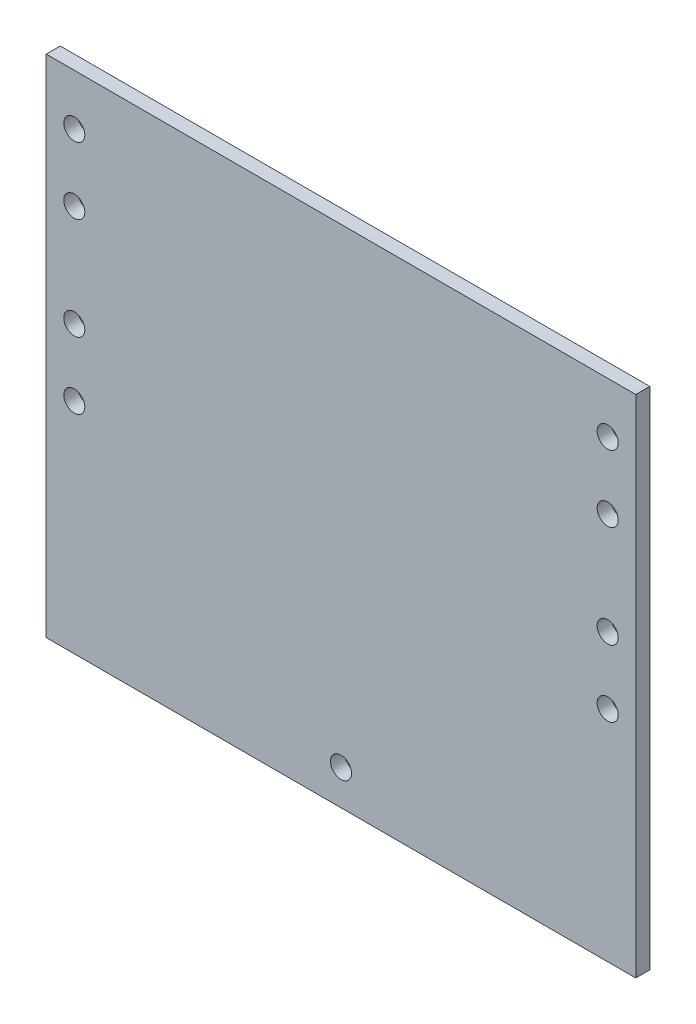
ISO-10303-21;
HEADER;
FILE_DESCRIPTION(('STEP AP214'),'2;1');
FILE_NAME('part.step','',(''),(''),'','','');
FILE_SCHEMA(('AUTOMOTIVE_DESIGN { 1 0 10303 214 1 1 1 1 }'));
ENDSEC;
DATA;
#1=APPLICATION_CONTEXT('core data for automotive mechanical design processes');
#2=APPLICATION_PROTOCOL_DEFINITION('international standard','automotive_design',2000,#1);
#3=PRODUCT_CONTEXT('',#1,'mechanical');
#4=PRODUCT('Part','Part','',(#3));
#5=PRODUCT_RELATED_PRODUCT_CATEGORY('part','',(#4));
#6=PRODUCT_DEFINITION_FORMATION('','',#4);
#7=PRODUCT_DEFINITION_CONTEXT('part definition',#1,'design');
#8=PRODUCT_DEFINITION('design','',#6,#7);
#9=PRODUCT_DEFINITION_SHAPE('','',#8);
#10=(LENGTH_UNIT() NAMED_UNIT(*) SI_UNIT(.MILLI.,.METRE.));
#11=(NAMED_UNIT(*) PLANE_ANGLE_UNIT() SI_UNIT($,.RADIAN.));
#12=(NAMED_UNIT(*) SI_UNIT($,.STERADIAN.) SOLID_ANGLE_UNIT());
#13=UNCERTAINTY_MEASURE_WITH_UNIT(LENGTH_MEASURE(1.E-05),#10,'distance_accuracy_value','');
#14=(GEOMETRIC_REPRESENTATION_CONTEXT(3) GLOBAL_UNCERTAINTY_ASSIGNED_CONTEXT((#13)) GLOBAL_UNIT_ASSIGNED_CONTEXT((#10,
#11,#12)) REPRESENTATION_CONTEXT('',''));
#15=CARTESIAN_POINT('',(0.,0.,0.));
#16=DIRECTION('',(0.,0.,1.));
#17=DIRECTION('',(1.,0.,0.));
#18=AXIS2_PLACEMENT_3D('',#15,#16,#17);
#19=CARTESIAN_POINT('',(0.,0.,12.7));
#20=DIRECTION('',(1.,0.,0.));
#21=DIRECTION('',(0.,1.,0.));
#22=AXIS2_PLACEMENT_3D('',#19,#20,#21);
#23=PLANE('',#22);
#24=DIRECTION('',(0.,-1.,0.));
#25=VECTOR('',#24,1.);
#26=CARTESIAN_POINT('',(0.,0.,0.));
#27=LINE('',#26,#25);
#28=CARTESIAN_POINT('',(0.,0.,0.));
#29=VERTEX_POINT('',#28);
#30=CARTESIAN_POINT('',(0.,-457.2,0.));
#31=VERTEX_POINT('',#30);
#32=EDGE_CURVE('E80',#29,#31,#27,.T.);
#33=ORIENTED_EDGE('',*,*,#32,.T.);
#34=DIRECTION('',(0.,0.,-1.));
#35=VECTOR('',#34,1.);
#36=CARTESIAN_POINT('',(0.,-457.2,12.7));
#37=LINE('',#36,#35);
#38=CARTESIAN_POINT('',(0.,-457.2,12.7));
#39=VERTEX_POINT('',#38);
#40=EDGE_CURVE('E11',#39,#31,#37,.T.);
#41=ORIENTED_EDGE('',*,*,#40,.F.);
#42=DIRECTION('',(0.,-1.,0.));
#43=VECTOR('',#42,1.);
#44=CARTESIAN_POINT('',(0.,0.,12.7));
#45=LINE('',#44,#43);
#46=CARTESIAN_POINT('',(0.,0.,12.7));
#47=VERTEX_POINT('',#46);
#48=EDGE_CURVE('E68',#47,#39,#45,.T.);
#49=ORIENTED_EDGE('',*,*,#48,.F.);
#50=DIRECTION('',(0.,0.,-1.));
#51=VECTOR('',#50,1.);
#52=CARTESIAN_POINT('',(0.,0.,12.7));
#53=LINE('',#52,#51);
#54=EDGE_CURVE('E76',#47,#29,#53,.T.);
#55=ORIENTED_EDGE('',*,*,#54,.T.);
#56=EDGE_LOOP('',(#33,#41,#49,#55));
#57=FACE_BOUND('',#56,.T.);
#58=ADVANCED_FACE('F17',(#57),#23,.F.);
#59=CARTESIAN_POINT('',(0.,-457.2,12.7));
#60=DIRECTION('',(0.,1.,0.));
#61=DIRECTION('',(0.,0.,1.));
#62=AXIS2_PLACEMENT_3D('',#59,#60,#61);
#63=PLANE('',#62);
#64=DIRECTION('',(1.,0.,0.));
#65=VECTOR('',#64,1.);
#66=CARTESIAN_POINT('',(0.,-457.2,0.));
#67=LINE('',#66,#65);
#68=CARTESIAN_POINT('',(533.4,-457.2,0.));
#69=VERTEX_POINT('',#68);
#70=EDGE_CURVE('E72',#31,#69,#67,.T.);
#71=ORIENTED_EDGE('',*,*,#70,.T.);
#72=DIRECTION('',(0.,0.,-1.));
#73=VECTOR('',#72,1.);
#74=CARTESIAN_POINT('',(533.4,-457.2,12.7));
#75=LINE('',#74,#73);
#76=CARTESIAN_POINT('',(533.4,-457.2,12.7));
#77=VERTEX_POINT('',#76);
#78=EDGE_CURVE('E25',#77,#69,#75,.T.);
#79=ORIENTED_EDGE('',*,*,#78,.F.);
#80=DIRECTION('',(1.,0.,0.));
#81=VECTOR('',#80,1.);
#82=CARTESIAN_POINT('',(0.,-457.2,12.7));
#83=LINE('',#82,#81);
#84=EDGE_CURVE('E63',#39,#77,#83,.T.);
#85=ORIENTED_EDGE('',*,*,#84,.F.);
#86=ORIENTED_EDGE('',*,*,#40,.T.);
#87=EDGE_LOOP('',(#71,#79,#85,#86));
#88=FACE_BOUND('',#87,.T.);
#89=ADVANCED_FACE('F71',(#88),#63,.F.);
#90=CARTESIAN_POINT('',(533.4,0.,12.7));
#91=DIRECTION('',(-1.,0.,0.));
#92=DIRECTION('',(0.,-1.,0.));
#93=AXIS2_PLACEMENT_3D('',#90,#91,#92);
#94=PLANE('',#93);
#95=DIRECTION('',(0.,1.,0.));
#96=VECTOR('',#95,1.);
#97=CARTESIAN_POINT('',(533.4,0.,0.));
#98=LINE('',#97,#96);
#99=CARTESIAN_POINT('',(533.4,0.,0.));
#100=VERTEX_POINT('',#99);
#101=EDGE_CURVE('E50',#69,#100,#98,.T.);
#102=ORIENTED_EDGE('',*,*,#101,.T.);
#103=DIRECTION('',(0.,0.,-1.));
#104=VECTOR('',#103,1.);
#105=CARTESIAN_POINT('',(533.4,0.,12.7));
#106=LINE('',#105,#104);
#107=CARTESIAN_POINT('',(533.4,0.,12.7));
#108=VERTEX_POINT('',#107);
#109=EDGE_CURVE('E73',#108,#100,#106,.T.);
#110=ORIENTED_EDGE('',*,*,#109,.F.);
#111=DIRECTION('',(0.,1.,0.));
#112=VECTOR('',#111,1.);
#113=CARTESIAN_POINT('',(533.4,0.,12.7));
#114=LINE('',#113,#112);
#115=EDGE_CURVE('E66',#77,#108,#114,.T.);
#116=ORIENTED_EDGE('',*,*,#115,.F.);
#117=ORIENTED_EDGE('',*,*,#78,.T.);
#118=EDGE_LOOP('',(#102,#110,#116,#117));
#119=FACE_BOUND('',#118,.T.);
#120=ADVANCED_FACE('F74',(#119),#94,.F.);
#121=CARTESIAN_POINT('',(0.,0.,12.7));
#122=DIRECTION('',(0.,-1.,0.));
#123=DIRECTION('',(0.,0.,-1.));
#124=AXIS2_PLACEMENT_3D('',#121,#122,#123);
#125=PLANE('',#124);
#126=DIRECTION('',(-1.,0.,0.));
#127=VECTOR('',#126,1.);
#128=CARTESIAN_POINT('',(0.,0.,0.));
#129=LINE('',#128,#127);
#130=EDGE_CURVE('E56',#100,#29,#129,.T.);
#131=ORIENTED_EDGE('',*,*,#130,.T.);
#132=ORIENTED_EDGE('',*,*,#54,.F.);
#133=DIRECTION('',(-1.,0.,0.));
#134=VECTOR('',#133,1.);
#135=CARTESIAN_POINT('',(0.,0.,12.7));
#136=LINE('',#135,#134);
#137=EDGE_CURVE('E33',#108,#47,#136,.T.);
#138=ORIENTED_EDGE('',*,*,#137,.F.);
#139=ORIENTED_EDGE('',*,*,#109,.T.);
#140=EDGE_LOOP('',(#131,#132,#138,#139));
#141=FACE_BOUND('',#140,.T.);
#142=ADVANCED_FACE('F88',(#141),#125,.F.);
#143=CARTESIAN_POINT('',(0.,0.,12.7));
#144=DIRECTION('',(0.,0.,1.));
#145=DIRECTION('',(1.,0.,0.));
#146=AXIS2_PLACEMENT_3D('',#143,#144,#145);
#147=PLANE('',#146);
#148=CARTESIAN_POINT('',(266.7,-425.45,12.7));
#149=DIRECTION('',(0.,0.,-1.));
#150=DIRECTION('',(-1.,0.,0.));
#151=AXIS2_PLACEMENT_3D('',#148,#149,#150);
#152=CIRCLE('',#151,9.525);
#153=CARTESIAN_POINT('',(257.175,-425.45,12.7));
#154=VERTEX_POINT('',#153);
#155=EDGE_CURVE('E139',#154,#154,#152,.T.);
#156=ORIENTED_EDGE('',*,*,#155,.T.);
#157=EDGE_LOOP('',(#156));
#158=FACE_BOUND('',#157,.T.);
#159=CARTESIAN_POINT('',(25.4,-45.974,12.7));
#160=DIRECTION('',(0.,0.,-1.));
#161=DIRECTION('',(1.,0.,0.));
#162=AXIS2_PLACEMENT_3D('',#159,#160,#161);
#163=CIRCLE('',#162,9.525);
#164=CARTESIAN_POINT('',(34.925,-45.974,12.7));
#165=VERTEX_POINT('',#164);
#166=EDGE_CURVE('E133',#165,#165,#163,.T.);
#167=ORIENTED_EDGE('',*,*,#166,.T.);
#168=EDGE_LOOP('',(#167));
#169=FACE_BOUND('',#168,.T.);
#170=CARTESIAN_POINT('',(25.4,-106.426,12.7));
#171=DIRECTION('',(0.,0.,-1.));
#172=DIRECTION('',(1.,0.,0.));
#173=AXIS2_PLACEMENT_3D('',#170,#171,#172);
#174=CIRCLE('',#173,9.525);
#175=CARTESIAN_POINT('',(34.925,-106.426,12.7));
#176=VERTEX_POINT('',#175);
#177=EDGE_CURVE('E127',#176,#176,#174,.T.);
#178=ORIENTED_EDGE('',*,*,#177,.T.);
#179=EDGE_LOOP('',(#178));
#180=FACE_BOUND('',#179,.T.);
#181=CARTESIAN_POINT('',(25.4,-198.628,12.7));
#182=DIRECTION('',(0.,0.,-1.));
#183=DIRECTION('',(1.,0.,0.));
#184=AXIS2_PLACEMENT_3D('',#181,#182,#183);
#185=CIRCLE('',#184,9.525);
#186=CARTESIAN_POINT('',(34.925,-198.628,12.7));
#187=VERTEX_POINT('',#186);
#188=EDGE_CURVE('E121',#187,#187,#185,.T.);
#189=ORIENTED_EDGE('',*,*,#188,.T.);
#190=EDGE_LOOP('',(#189));
#191=FACE_BOUND('',#190,.T.);
#192=CARTESIAN_POINT('',(25.4,-259.08,12.7));
#193=DIRECTION('',(0.,0.,-1.));
#194=DIRECTION('',(1.,0.,0.));
#195=AXIS2_PLACEMENT_3D('',#192,#193,#194);
#196=CIRCLE('',#195,9.525);
#197=CARTESIAN_POINT('',(34.925,-259.08,12.7));
#198=VERTEX_POINT('',#197);
#199=EDGE_CURVE('E115',#198,#198,#196,.T.);
#200=ORIENTED_EDGE('',*,*,#199,.T.);
#201=EDGE_LOOP('',(#200));
#202=FACE_BOUND('',#201,.T.);
#203=CARTESIAN_POINT('',(508.,-259.08,12.7));
#204=DIRECTION('',(0.,0.,-1.));
#205=DIRECTION('',(-1.,0.,0.));
#206=AXIS2_PLACEMENT_3D('',#203,#204,#205);
#207=CIRCLE('',#206,9.525);
#208=CARTESIAN_POINT('',(498.475,-259.08,12.7));
#209=VERTEX_POINT('',#208);
#210=EDGE_CURVE('E109',#209,#209,#207,.T.);
#211=ORIENTED_EDGE('',*,*,#210,.T.);
#212=EDGE_LOOP('',(#211));
#213=FACE_BOUND('',#212,.T.);
#214=CARTESIAN_POINT('',(508.,-198.628,12.7));
#215=DIRECTION('',(0.,0.,-1.));
#216=DIRECTION('',(-1.,0.,0.));
#217=AXIS2_PLACEMENT_3D('',#214,#215,#216);
#218=CIRCLE('',#217,9.525);
#219=CARTESIAN_POINT('',(498.475,-198.628,12.7));
#220=VERTEX_POINT('',#219);
#221=EDGE_CURVE('E103',#220,#220,#218,.T.);
#222=ORIENTED_EDGE('',*,*,#221,.T.);
#223=EDGE_LOOP('',(#222));
#224=FACE_BOUND('',#223,.T.);
#225=CARTESIAN_POINT('',(508.,-106.426,12.7));
#226=DIRECTION('',(0.,0.,-1.));
#227=DIRECTION('',(-1.,0.,0.));
#228=AXIS2_PLACEMENT_3D('',#225,#226,#227);
#229=CIRCLE('',#228,9.525);
#230=CARTESIAN_POINT('',(498.475,-106.426,12.7));
#231=VERTEX_POINT('',#230);
#232=EDGE_CURVE('E97',#231,#231,#229,.T.);
#233=ORIENTED_EDGE('',*,*,#232,.T.);
#234=EDGE_LOOP('',(#233));
#235=FACE_BOUND('',#234,.T.);
#236=CARTESIAN_POINT('',(508.,-45.974,12.7));
#237=DIRECTION('',(0.,0.,-1.));
#238=DIRECTION('',(-1.,0.,0.));
#239=AXIS2_PLACEMENT_3D('',#236,#237,#238);
#240=CIRCLE('',#239,9.525);
#241=CARTESIAN_POINT('',(498.475,-45.974,12.7));
#242=VERTEX_POINT('',#241);
#243=EDGE_CURVE('E83',#242,#242,#240,.T.);
#244=ORIENTED_EDGE('',*,*,#243,.T.);
#245=EDGE_LOOP('',(#244));
#246=FACE_BOUND('',#245,.T.);
#247=ORIENTED_EDGE('',*,*,#48,.T.);
#248=ORIENTED_EDGE('',*,*,#84,.T.);
#249=ORIENTED_EDGE('',*,*,#115,.T.);
#250=ORIENTED_EDGE('',*,*,#137,.T.);
#251=EDGE_LOOP('',(#247,#248,#249,#250));
#252=FACE_BOUND('',#251,.T.);
#253=ADVANCED_FACE('F64',(#158,#169,#180,#191,#202,#213,#224,#235,#246,#252),#147,.T.);
#254=CARTESIAN_POINT('',(0.,0.,0.));
#255=DIRECTION('',(0.,0.,1.));
#256=DIRECTION('',(1.,0.,0.));
#257=AXIS2_PLACEMENT_3D('',#254,#255,#256);
#258=PLANE('',#257);
#259=CARTESIAN_POINT('',(266.7,-425.45,0.));
#260=DIRECTION('',(0.,0.,-1.));
#261=DIRECTION('',(-1.,0.,0.));
#262=AXIS2_PLACEMENT_3D('',#259,#260,#261);
#263=CIRCLE('',#262,9.525);
#264=CARTESIAN_POINT('',(257.175,-425.45,0.));
#265=VERTEX_POINT('',#264);
#266=EDGE_CURVE('E142',#265,#265,#263,.T.);
#267=ORIENTED_EDGE('',*,*,#266,.F.);
#268=EDGE_LOOP('',(#267));
#269=FACE_BOUND('',#268,.T.);
#270=CARTESIAN_POINT('',(25.4,-45.974,0.));
#271=DIRECTION('',(0.,0.,-1.));
#272=DIRECTION('',(1.,0.,0.));
#273=AXIS2_PLACEMENT_3D('',#270,#271,#272);
#274=CIRCLE('',#273,9.525);
#275=CARTESIAN_POINT('',(34.925,-45.974,0.));
#276=VERTEX_POINT('',#275);
#277=EDGE_CURVE('E136',#276,#276,#274,.T.);
#278=ORIENTED_EDGE('',*,*,#277,.F.);
#279=EDGE_LOOP('',(#278));
#280=FACE_BOUND('',#279,.T.);
#281=CARTESIAN_POINT('',(25.4,-106.426,0.));
#282=DIRECTION('',(0.,0.,-1.));
#283=DIRECTION('',(1.,0.,0.));
#284=AXIS2_PLACEMENT_3D('',#281,#282,#283);
#285=CIRCLE('',#284,9.525);
#286=CARTESIAN_POINT('',(34.925,-106.426,0.));
#287=VERTEX_POINT('',#286);
#288=EDGE_CURVE('E130',#287,#287,#285,.T.);
#289=ORIENTED_EDGE('',*,*,#288,.F.);
#290=EDGE_LOOP('',(#289));
#291=FACE_BOUND('',#290,.T.);
#292=CARTESIAN_POINT('',(25.4,-198.628,0.));
#293=DIRECTION('',(0.,0.,-1.));
#294=DIRECTION('',(1.,0.,0.));
#295=AXIS2_PLACEMENT_3D('',#292,#293,#294);
#296=CIRCLE('',#295,9.525);
#297=CARTESIAN_POINT('',(34.925,-198.628,0.));
#298=VERTEX_POINT('',#297);
#299=EDGE_CURVE('E124',#298,#298,#296,.T.);
#300=ORIENTED_EDGE('',*,*,#299,.F.);
#301=EDGE_LOOP('',(#300));
#302=FACE_BOUND('',#301,.T.);
#303=CARTESIAN_POINT('',(25.4,-259.08,0.));
#304=DIRECTION('',(0.,0.,-1.));
#305=DIRECTION('',(1.,0.,0.));
#306=AXIS2_PLACEMENT_3D('',#303,#304,#305);
#307=CIRCLE('',#306,9.525);
#308=CARTESIAN_POINT('',(34.925,-259.08,0.));
#309=VERTEX_POINT('',#308);
#310=EDGE_CURVE('E118',#309,#309,#307,.T.);
#311=ORIENTED_EDGE('',*,*,#310,.F.);
#312=EDGE_LOOP('',(#311));
#313=FACE_BOUND('',#312,.T.);
#314=CARTESIAN_POINT('',(508.,-259.08,0.));
#315=DIRECTION('',(0.,0.,-1.));
#316=DIRECTION('',(-1.,0.,0.));
#317=AXIS2_PLACEMENT_3D('',#314,#315,#316);
#318=CIRCLE('',#317,9.525);
#319=CARTESIAN_POINT('',(498.475,-259.08,0.));
#320=VERTEX_POINT('',#319);
#321=EDGE_CURVE('E112',#320,#320,#318,.T.);
#322=ORIENTED_EDGE('',*,*,#321,.F.);
#323=EDGE_LOOP('',(#322));
#324=FACE_BOUND('',#323,.T.);
#325=CARTESIAN_POINT('',(508.,-198.628,0.));
#326=DIRECTION('',(0.,0.,-1.));
#327=DIRECTION('',(-1.,0.,0.));
#328=AXIS2_PLACEMENT_3D('',#325,#326,#327);
#329=CIRCLE('',#328,9.525);
#330=CARTESIAN_POINT('',(498.475,-198.628,0.));
#331=VERTEX_POINT('',#330);
#332=EDGE_CURVE('E106',#331,#331,#329,.T.);
#333=ORIENTED_EDGE('',*,*,#332,.F.);
#334=EDGE_LOOP('',(#333));
#335=FACE_BOUND('',#334,.T.);
#336=CARTESIAN_POINT('',(508.,-106.426,0.));
#337=DIRECTION('',(0.,0.,-1.));
#338=DIRECTION('',(-1.,0.,0.));
#339=AXIS2_PLACEMENT_3D('',#336,#337,#338);
#340=CIRCLE('',#339,9.525);
#341=CARTESIAN_POINT('',(498.475,-106.426,0.));
#342=VERTEX_POINT('',#341);
#343=EDGE_CURVE('E100',#342,#342,#340,.T.);
#344=ORIENTED_EDGE('',*,*,#343,.F.);
#345=EDGE_LOOP('',(#344));
#346=FACE_BOUND('',#345,.T.);
#347=CARTESIAN_POINT('',(508.,-45.974,0.));
#348=DIRECTION('',(0.,0.,-1.));
#349=DIRECTION('',(-1.,0.,0.));
#350=AXIS2_PLACEMENT_3D('',#347,#348,#349);
#351=CIRCLE('',#350,9.525);
#352=CARTESIAN_POINT('',(498.475,-45.974,0.));
#353=VERTEX_POINT('',#352);
#354=EDGE_CURVE('E94',#353,#353,#351,.T.);
#355=ORIENTED_EDGE('',*,*,#354,.F.);
#356=EDGE_LOOP('',(#355));
#357=FACE_BOUND('',#356,.T.);
#358=ORIENTED_EDGE('',*,*,#32,.F.);
#359=ORIENTED_EDGE('',*,*,#130,.F.);
#360=ORIENTED_EDGE('',*,*,#101,.F.);
#361=ORIENTED_EDGE('',*,*,#70,.F.);
#362=EDGE_LOOP('',(#358,#359,#360,#361));
#363=FACE_BOUND('',#362,.T.);
#364=ADVANCED_FACE('F91',(#269,#280,#291,#302,#313,#324,#335,#346,#357,#363),#258,.F.);
#365=CARTESIAN_POINT('',(508.,-45.974,12.7));
#366=DIRECTION('',(0.,0.,-1.));
#367=DIRECTION('',(-1.,0.,0.));
#368=AXIS2_PLACEMENT_3D('',#365,#366,#367);
#369=CYLINDRICAL_SURFACE('',#368,9.525);
#370=ORIENTED_EDGE('',*,*,#243,.F.);
#371=EDGE_LOOP('',(#370));
#372=FACE_BOUND('',#371,.T.);
#373=ORIENTED_EDGE('',*,*,#354,.T.);
#374=EDGE_LOOP('',(#373));
#375=FACE_BOUND('',#374,.T.);
#376=ADVANCED_FACE('F159',(#372,#375),#369,.F.);
#377=CARTESIAN_POINT('',(508.,-106.426,12.7));
#378=DIRECTION('',(0.,0.,-1.));
#379=DIRECTION('',(-1.,0.,0.));
#380=AXIS2_PLACEMENT_3D('',#377,#378,#379);
#381=CYLINDRICAL_SURFACE('',#380,9.525);
#382=ORIENTED_EDGE('',*,*,#232,.F.);
#383=EDGE_LOOP('',(#382));
#384=FACE_BOUND('',#383,.T.);
#385=ORIENTED_EDGE('',*,*,#343,.T.);
#386=EDGE_LOOP('',(#385));
#387=FACE_BOUND('',#386,.T.);
#388=ADVANCED_FACE('F178',(#384,#387),#381,.F.);
#389=CARTESIAN_POINT('',(508.,-198.628,12.7));
#390=DIRECTION('',(0.,0.,-1.));
#391=DIRECTION('',(-1.,0.,0.));
#392=AXIS2_PLACEMENT_3D('',#389,#390,#391);
#393=CYLINDRICAL_SURFACE('',#392,9.525);
#394=ORIENTED_EDGE('',*,*,#221,.F.);
#395=EDGE_LOOP('',(#394));
#396=FACE_BOUND('',#395,.T.);
#397=ORIENTED_EDGE('',*,*,#332,.T.);
#398=EDGE_LOOP('',(#397));
#399=FACE_BOUND('',#398,.T.);
#400=ADVANCED_FACE('F186',(#396,#399),#393,.F.);
#401=CARTESIAN_POINT('',(508.,-259.08,12.7));
#402=DIRECTION('',(0.,0.,-1.));
#403=DIRECTION('',(-1.,0.,0.));
#404=AXIS2_PLACEMENT_3D('',#401,#402,#403);
#405=CYLINDRICAL_SURFACE('',#404,9.525);
#406=ORIENTED_EDGE('',*,*,#210,.F.);
#407=EDGE_LOOP('',(#406));
#408=FACE_BOUND('',#407,.T.);
#409=ORIENTED_EDGE('',*,*,#321,.T.);
#410=EDGE_LOOP('',(#409));
#411=FACE_BOUND('',#410,.T.);
#412=ADVANCED_FACE('F239',(#408,#411),#405,.F.);
#413=CARTESIAN_POINT('',(25.4,-259.08,12.7));
#414=DIRECTION('',(0.,0.,-1.));
#415=DIRECTION('',(-1.,0.,0.));
#416=AXIS2_PLACEMENT_3D('',#413,#414,#415);
#417=CYLINDRICAL_SURFACE('',#416,9.525);
#418=ORIENTED_EDGE('',*,*,#199,.F.);
#419=EDGE_LOOP('',(#418));
#420=FACE_BOUND('',#419,.T.);
#421=ORIENTED_EDGE('',*,*,#310,.T.);
#422=EDGE_LOOP('',(#421));
#423=FACE_BOUND('',#422,.T.);
#424=ADVANCED_FACE('F249',(#420,#423),#417,.F.);
#425=CARTESIAN_POINT('',(25.4,-198.628,12.7));
#426=DIRECTION('',(0.,0.,-1.));
#427=DIRECTION('',(-1.,0.,0.));
#428=AXIS2_PLACEMENT_3D('',#425,#426,#427);
#429=CYLINDRICAL_SURFACE('',#428,9.525);
#430=ORIENTED_EDGE('',*,*,#188,.F.);
#431=EDGE_LOOP('',(#430));
#432=FACE_BOUND('',#431,.T.);
#433=ORIENTED_EDGE('',*,*,#299,.T.);
#434=EDGE_LOOP('',(#433));
#435=FACE_BOUND('',#434,.T.);
#436=ADVANCED_FACE('F259',(#432,#435),#429,.F.);
#437=CARTESIAN_POINT('',(25.4,-106.426,12.7));
#438=DIRECTION('',(0.,0.,-1.));
#439=DIRECTION('',(-1.,0.,0.));
#440=AXIS2_PLACEMENT_3D('',#437,#438,#439);
#441=CYLINDRICAL_SURFACE('',#440,9.525);
#442=ORIENTED_EDGE('',*,*,#177,.F.);
#443=EDGE_LOOP('',(#442));
#444=FACE_BOUND('',#443,.T.);
#445=ORIENTED_EDGE('',*,*,#288,.T.);
#446=EDGE_LOOP('',(#445));
#447=FACE_BOUND('',#446,.T.);
#448=ADVANCED_FACE('F269',(#444,#447),#441,.F.);
#449=CARTESIAN_POINT('',(25.4,-45.974,12.7));
#450=DIRECTION('',(0.,0.,-1.));
#451=DIRECTION('',(-1.,0.,0.));
#452=AXIS2_PLACEMENT_3D('',#449,#450,#451);
#453=CYLINDRICAL_SURFACE('',#452,9.525);
#454=ORIENTED_EDGE('',*,*,#166,.F.);
#455=EDGE_LOOP('',(#454));
#456=FACE_BOUND('',#455,.T.);
#457=ORIENTED_EDGE('',*,*,#277,.T.);
#458=EDGE_LOOP('',(#457));
#459=FACE_BOUND('',#458,.T.);
#460=ADVANCED_FACE('F153',(#456,#459),#453,.F.);
#461=CARTESIAN_POINT('',(266.7,-425.45,12.7));
#462=DIRECTION('',(0.,0.,-1.));
#463=DIRECTION('',(-1.,0.,0.));
#464=AXIS2_PLACEMENT_3D('',#461,#462,#463);
#465=CYLINDRICAL_SURFACE('',#464,9.525);
#466=ORIENTED_EDGE('',*,*,#155,.F.);
#467=EDGE_LOOP('',(#466));
#468=FACE_BOUND('',#467,.T.);
#469=ORIENTED_EDGE('',*,*,#266,.T.);
#470=EDGE_LOOP('',(#469));
#471=FACE_BOUND('',#470,.T.);
#472=ADVANCED_FACE('F150',(#468,#471),#465,.F.);
#473=CLOSED_SHELL('',(#58,#89,#120,#142,#253,#364,#376,#388,#400,#412,#424,#436,#448,#460,#472));
#474=MANIFOLD_SOLID_BREP('B1',#473);
#475=ADVANCED_BREP_SHAPE_REPRESENTATION('',(#18,#474),#14);
#476=SHAPE_DEFINITION_REPRESENTATION(#9,#475);
ENDSEC;
END-ISO-10303-21;
